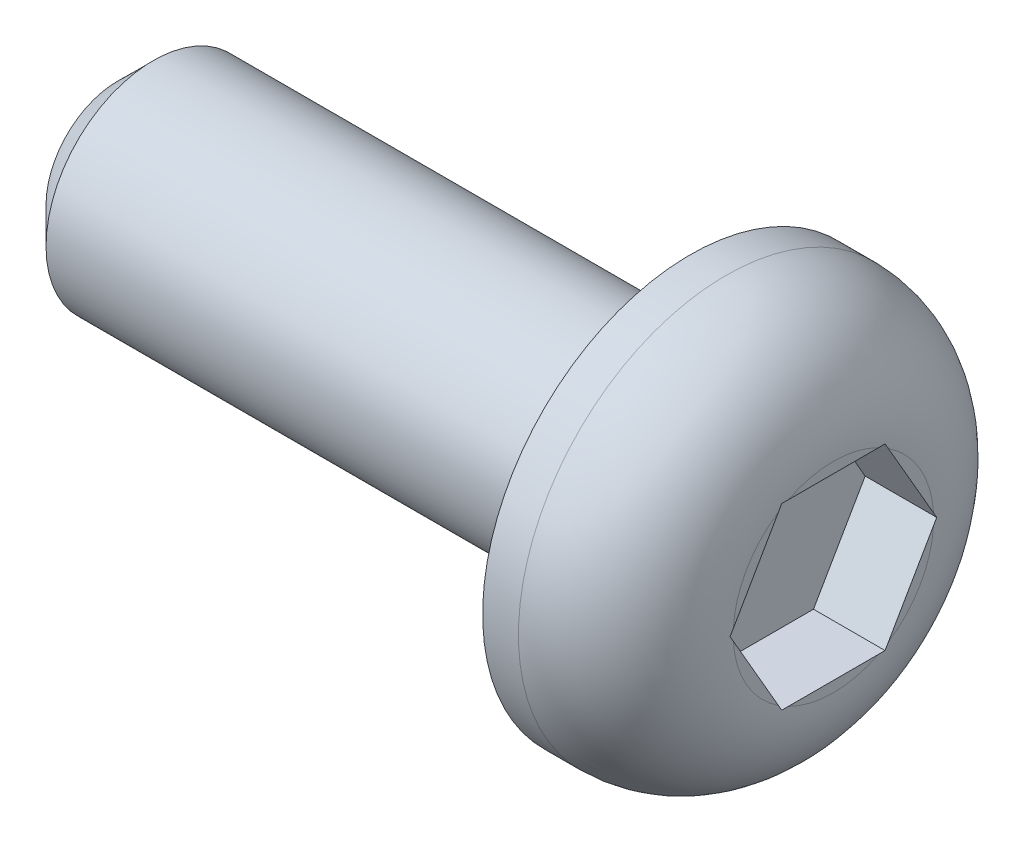
ISO-10303-21;
HEADER;
FILE_DESCRIPTION(('STEP AP214'),'2;1');
FILE_NAME('part.step','',(''),(''),'','','');
FILE_SCHEMA(('AUTOMOTIVE_DESIGN { 1 0 10303 214 1 1 1 1 }'));
ENDSEC;
DATA;
#1=APPLICATION_CONTEXT('core data for automotive mechanical design processes');
#2=APPLICATION_PROTOCOL_DEFINITION('international standard','automotive_design',2000,#1);
#3=PRODUCT_CONTEXT('',#1,'mechanical');
#4=PRODUCT('Part','Part','',(#3));
#5=PRODUCT_RELATED_PRODUCT_CATEGORY('part','',(#4));
#6=PRODUCT_DEFINITION_FORMATION('','',#4);
#7=PRODUCT_DEFINITION_CONTEXT('part definition',#1,'design');
#8=PRODUCT_DEFINITION('design','',#6,#7);
#9=PRODUCT_DEFINITION_SHAPE('','',#8);
#10=(LENGTH_UNIT() NAMED_UNIT(*) SI_UNIT(.MILLI.,.METRE.));
#11=(NAMED_UNIT(*) PLANE_ANGLE_UNIT() SI_UNIT($,.RADIAN.));
#12=(NAMED_UNIT(*) SI_UNIT($,.STERADIAN.) SOLID_ANGLE_UNIT());
#13=UNCERTAINTY_MEASURE_WITH_UNIT(LENGTH_MEASURE(1.E-05),#10,'distance_accuracy_value','');
#14=(GEOMETRIC_REPRESENTATION_CONTEXT(3) GLOBAL_UNCERTAINTY_ASSIGNED_CONTEXT((#13)) GLOBAL_UNIT_ASSIGNED_CONTEXT((#10,
#11,#12)) REPRESENTATION_CONTEXT('',''));
#15=CARTESIAN_POINT('',(0.,0.,0.));
#16=DIRECTION('',(0.,0.,1.));
#17=DIRECTION('',(1.,0.,0.));
#18=AXIS2_PLACEMENT_3D('',#15,#16,#17);
#19=CARTESIAN_POINT('',(2.,0.,0.));
#20=DIRECTION('',(1.,0.,0.));
#21=DIRECTION('',(0.,0.,-1.));
#22=AXIS2_PLACEMENT_3D('',#19,#20,#21);
#23=PLANE('',#22);
#24=DIRECTION('',(0.,-0.866025403784439,-0.5));
#25=VECTOR('',#24,1.);
#26=CARTESIAN_POINT('',(2.,0.,2.94337567297406));
#27=LINE('',#26,#25);
#28=CARTESIAN_POINT('',(2.,-0.0789917583039618,2.89776976005351));
#29=VERTEX_POINT('',#28);
#30=CARTESIAN_POINT('',(2.,-1.17100824169604,2.26729374940759));
#31=VERTEX_POINT('',#30);
#32=EDGE_CURVE('E164',#29,#31,#27,.T.);
#33=ORIENTED_EDGE('',*,*,#32,.F.);
#34=CARTESIAN_POINT('',(2.,0.,1.5));
#35=DIRECTION('',(1.,0.,0.));
#36=DIRECTION('',(0.,0.,-1.));
#37=AXIS2_PLACEMENT_3D('',#34,#35,#36);
#38=CIRCLE('',#37,1.4);
#39=EDGE_CURVE('E201',#29,#31,#38,.T.);
#40=ORIENTED_EDGE('',*,*,#39,.T.);
#41=EDGE_LOOP('',(#33,#40));
#42=FACE_BOUND('',#41,.T.);
#43=ADVANCED_FACE('F34',(#42),#23,.T.);
#44=DIRECTION('',(0.,0.,-1.));
#45=VECTOR('',#44,1.);
#46=CARTESIAN_POINT('',(2.,-1.25,2.22168783648703));
#47=LINE('',#46,#45);
#48=CARTESIAN_POINT('',(2.,-1.25,2.13047601064592));
#49=VERTEX_POINT('',#48);
#50=CARTESIAN_POINT('',(2.,-1.25,0.869523989354076));
#51=VERTEX_POINT('',#50);
#52=EDGE_CURVE('E166',#49,#51,#47,.T.);
#53=ORIENTED_EDGE('',*,*,#52,.F.);
#54=CARTESIAN_POINT('',(2.,0.,1.5));
#55=DIRECTION('',(1.,0.,0.));
#56=DIRECTION('',(0.,0.,-1.));
#57=AXIS2_PLACEMENT_3D('',#54,#55,#56);
#58=CIRCLE('',#57,1.4);
#59=EDGE_CURVE('E199',#49,#51,#58,.T.);
#60=ORIENTED_EDGE('',*,*,#59,.T.);
#61=EDGE_LOOP('',(#53,#60));
#62=FACE_BOUND('',#61,.T.);
#63=ADVANCED_FACE('F254',(#62),#23,.T.);
#64=DIRECTION('',(0.,0.866025403784439,-0.5));
#65=VECTOR('',#64,1.);
#66=CARTESIAN_POINT('',(2.,-1.25,0.778312163512968));
#67=LINE('',#66,#65);
#68=CARTESIAN_POINT('',(2.,-1.17100824169604,0.732706250592413));
#69=VERTEX_POINT('',#68);
#70=CARTESIAN_POINT('',(2.,-0.0789917583039615,0.102230239946489));
#71=VERTEX_POINT('',#70);
#72=EDGE_CURVE('E169',#69,#71,#67,.T.);
#73=ORIENTED_EDGE('',*,*,#72,.F.);
#74=CARTESIAN_POINT('',(2.,0.,1.5));
#75=DIRECTION('',(1.,0.,0.));
#76=DIRECTION('',(0.,0.,-1.));
#77=AXIS2_PLACEMENT_3D('',#74,#75,#76);
#78=CIRCLE('',#77,1.4);
#79=EDGE_CURVE('E197',#69,#71,#78,.T.);
#80=ORIENTED_EDGE('',*,*,#79,.T.);
#81=EDGE_LOOP('',(#73,#80));
#82=FACE_BOUND('',#81,.T.);
#83=ADVANCED_FACE('F259',(#82),#23,.T.);
#84=DIRECTION('',(0.,0.866025403784439,0.5));
#85=VECTOR('',#84,1.);
#86=CARTESIAN_POINT('',(2.,0.,0.0566243270259353));
#87=LINE('',#86,#85);
#88=CARTESIAN_POINT('',(2.,0.078991758303962,0.102230239946489));
#89=VERTEX_POINT('',#88);
#90=CARTESIAN_POINT('',(2.,1.17100824169604,0.732706250592413));
#91=VERTEX_POINT('',#90);
#92=EDGE_CURVE('E172',#89,#91,#87,.T.);
#93=ORIENTED_EDGE('',*,*,#92,.F.);
#94=CARTESIAN_POINT('',(2.,0.,1.5));
#95=DIRECTION('',(1.,0.,0.));
#96=DIRECTION('',(0.,0.,-1.));
#97=AXIS2_PLACEMENT_3D('',#94,#95,#96);
#98=CIRCLE('',#97,1.4);
#99=EDGE_CURVE('E195',#89,#91,#98,.T.);
#100=ORIENTED_EDGE('',*,*,#99,.T.);
#101=EDGE_LOOP('',(#93,#100));
#102=FACE_BOUND('',#101,.T.);
#103=ADVANCED_FACE('F249',(#102),#23,.T.);
#104=DIRECTION('',(0.,0.,1.));
#105=VECTOR('',#104,1.);
#106=CARTESIAN_POINT('',(2.,1.25,0.778312163512968));
#107=LINE('',#106,#105);
#108=CARTESIAN_POINT('',(2.,1.25,0.869523989354076));
#109=VERTEX_POINT('',#108);
#110=CARTESIAN_POINT('',(2.,1.25,2.13047601064592));
#111=VERTEX_POINT('',#110);
#112=EDGE_CURVE('E154',#109,#111,#107,.T.);
#113=ORIENTED_EDGE('',*,*,#112,.F.);
#114=CARTESIAN_POINT('',(2.,0.,1.5));
#115=DIRECTION('',(1.,0.,0.));
#116=DIRECTION('',(0.,0.,-1.));
#117=AXIS2_PLACEMENT_3D('',#114,#115,#116);
#118=CIRCLE('',#117,1.4);
#119=EDGE_CURVE('E193',#109,#111,#118,.T.);
#120=ORIENTED_EDGE('',*,*,#119,.T.);
#121=EDGE_LOOP('',(#113,#120));
#122=FACE_BOUND('',#121,.T.);
#123=ADVANCED_FACE('F240',(#122),#23,.T.);
#124=CARTESIAN_POINT('',(0.,0.,1.5));
#125=DIRECTION('',(1.,0.,0.));
#126=DIRECTION('',(0.,0.,-1.));
#127=AXIS2_PLACEMENT_3D('',#124,#125,#126);
#128=CYLINDRICAL_SURFACE('',#127,1.5);
#129=CARTESIAN_POINT('',(-7.5,0.,1.5));
#130=DIRECTION('',(-1.,0.,0.));
#131=DIRECTION('',(0.,0.,1.));
#132=AXIS2_PLACEMENT_3D('',#129,#130,#131);
#133=CIRCLE('',#132,1.5);
#134=CARTESIAN_POINT('',(-7.5,0.,3.));
#135=VERTEX_POINT('',#134);
#136=EDGE_CURVE('E42',#135,#135,#133,.F.);
#137=ORIENTED_EDGE('',*,*,#136,.T.);
#138=EDGE_LOOP('',(#137));
#139=FACE_BOUND('',#138,.T.);
#140=CARTESIAN_POINT('',(0.,0.,1.5));
#141=DIRECTION('',(1.,0.,0.));
#142=DIRECTION('',(0.,0.,-1.));
#143=AXIS2_PLACEMENT_3D('',#140,#141,#142);
#144=CIRCLE('',#143,1.5);
#145=CARTESIAN_POINT('',(0.,0.,0.));
#146=VERTEX_POINT('',#145);
#147=EDGE_CURVE('E177',#146,#146,#144,.T.);
#148=ORIENTED_EDGE('',*,*,#147,.F.);
#149=EDGE_LOOP('',(#148));
#150=FACE_BOUND('',#149,.T.);
#151=ADVANCED_FACE('F242',(#139,#150),#128,.T.);
#152=CARTESIAN_POINT('',(-8.,0.,0.));
#153=DIRECTION('',(-1.,0.,0.));
#154=DIRECTION('',(0.,0.,1.));
#155=AXIS2_PLACEMENT_3D('',#152,#153,#154);
#156=PLANE('',#155);
#157=CARTESIAN_POINT('',(-8.,0.,1.5));
#158=DIRECTION('',(-1.,0.,0.));
#159=DIRECTION('',(0.,0.,1.));
#160=AXIS2_PLACEMENT_3D('',#157,#158,#159);
#161=CIRCLE('',#160,0.999999999999998);
#162=CARTESIAN_POINT('',(-8.,0.,2.5));
#163=VERTEX_POINT('',#162);
#164=EDGE_CURVE('E11',#163,#163,#161,.T.);
#165=ORIENTED_EDGE('',*,*,#164,.T.);
#166=EDGE_LOOP('',(#165));
#167=FACE_BOUND('',#166,.T.);
#168=ADVANCED_FACE('F238',(#167),#156,.T.);
#169=DIRECTION('',(0.,-0.866025403784439,0.5));
#170=VECTOR('',#169,1.);
#171=CARTESIAN_POINT('',(2.,1.25,2.22168783648703));
#172=LINE('',#171,#170);
#173=CARTESIAN_POINT('',(2.,1.17100824169604,2.26729374940759));
#174=VERTEX_POINT('',#173);
#175=CARTESIAN_POINT('',(2.,0.0789917583039618,2.89776976005351));
#176=VERTEX_POINT('',#175);
#177=EDGE_CURVE('E151',#174,#176,#172,.T.);
#178=ORIENTED_EDGE('',*,*,#177,.F.);
#179=CARTESIAN_POINT('',(2.,0.,1.5));
#180=DIRECTION('',(1.,0.,0.));
#181=DIRECTION('',(0.,0.,-1.));
#182=AXIS2_PLACEMENT_3D('',#179,#180,#181);
#183=CIRCLE('',#182,1.4);
#184=EDGE_CURVE('E191',#174,#176,#183,.T.);
#185=ORIENTED_EDGE('',*,*,#184,.T.);
#186=EDGE_LOOP('',(#178,#185));
#187=FACE_BOUND('',#186,.T.);
#188=ADVANCED_FACE('F234',(#187),#23,.T.);
#189=CARTESIAN_POINT('',(0.,0.,1.5));
#190=DIRECTION('',(1.,0.,0.));
#191=DIRECTION('',(0.,0.,-1.));
#192=AXIS2_PLACEMENT_3D('',#189,#190,#191);
#193=CYLINDRICAL_SURFACE('',#192,2.9);
#194=CARTESIAN_POINT('',(0.5,0.,1.5));
#195=DIRECTION('',(1.,0.,0.));
#196=DIRECTION('',(0.,0.,-1.));
#197=AXIS2_PLACEMENT_3D('',#194,#195,#196);
#198=CIRCLE('',#197,2.9);
#199=CARTESIAN_POINT('',(0.5,0.,-1.4));
#200=VERTEX_POINT('',#199);
#201=EDGE_CURVE('E481',#200,#200,#198,.F.);
#202=ORIENTED_EDGE('',*,*,#201,.T.);
#203=EDGE_LOOP('',(#202));
#204=FACE_BOUND('',#203,.T.);
#205=CARTESIAN_POINT('',(0.,0.,1.5));
#206=DIRECTION('',(1.,0.,0.));
#207=DIRECTION('',(0.,0.,-1.));
#208=AXIS2_PLACEMENT_3D('',#205,#206,#207);
#209=CIRCLE('',#208,2.9);
#210=CARTESIAN_POINT('',(0.,0.,-1.4));
#211=VERTEX_POINT('',#210);
#212=EDGE_CURVE('E188',#211,#211,#209,.T.);
#213=ORIENTED_EDGE('',*,*,#212,.T.);
#214=EDGE_LOOP('',(#213));
#215=FACE_BOUND('',#214,.T.);
#216=ADVANCED_FACE('F230',(#204,#215),#193,.T.);
#217=CARTESIAN_POINT('',(0.,0.,0.));
#218=DIRECTION('',(1.,0.,0.));
#219=DIRECTION('',(0.,0.,-1.));
#220=AXIS2_PLACEMENT_3D('',#217,#218,#219);
#221=PLANE('',#220);
#222=ORIENTED_EDGE('',*,*,#212,.F.);
#223=EDGE_LOOP('',(#222));
#224=FACE_BOUND('',#223,.T.);
#225=ORIENTED_EDGE('',*,*,#147,.T.);
#226=EDGE_LOOP('',(#225));
#227=FACE_BOUND('',#226,.T.);
#228=ADVANCED_FACE('F224',(#224,#227),#221,.F.);
#229=CARTESIAN_POINT('',(1.,0.,2.94337567297406));
#230=DIRECTION('',(0.,-0.5,0.866025403784439));
#231=DIRECTION('',(0.,-0.866025403784439,-0.5));
#232=AXIS2_PLACEMENT_3D('',#229,#230,#231);
#233=PLANE('',#232);
#234=ORIENTED_EDGE('',*,*,#32,.T.);
#235=CARTESIAN_POINT('',(2.,-1.17100824169604,2.26729374940759));
#236=CARTESIAN_POINT('',(2.00000539805275,-1.1841741811381,2.25969239072658));
#237=CARTESIAN_POINT('',(1.99995582374529,-1.19733979317484,2.25209122107312));
#238=CARTESIAN_POINT('',(1.99974673027623,-1.223670379277,2.23688925009912));
#239=CARTESIAN_POINT('',(1.999587210974,-1.23683535334158,2.22928844877906));
#240=CARTESIAN_POINT('',(1.99937271917094,-1.25,2.22168783648703));
#241=B_SPLINE_CURVE_WITH_KNOTS('',3,(#235,#236,#237,#238,#239,#240),.UNSPECIFIED.,.F.,.F.,(4,2,
4),(0.,0.0456072604102866,0.091214579155444),.UNSPECIFIED.);
#242=CARTESIAN_POINT('',(1.99937271917094,-1.25,2.22168783648703));
#243=VERTEX_POINT('',#242);
#244=EDGE_CURVE('E133',#31,#243,#241,.T.);
#245=ORIENTED_EDGE('',*,*,#244,.T.);
#246=DIRECTION('',(1.,0.,0.));
#247=VECTOR('',#246,1.);
#248=CARTESIAN_POINT('',(1.,-1.25,2.22168783648703));
#249=LINE('',#248,#247);
#250=CARTESIAN_POINT('',(1.,-1.25,2.22168783648703));
#251=VERTEX_POINT('',#250);
#252=EDGE_CURVE('E125',#251,#243,#249,.T.);
#253=ORIENTED_EDGE('',*,*,#252,.F.);
#254=DIRECTION('',(0.,-0.866025403784439,-0.5));
#255=VECTOR('',#254,1.);
#256=CARTESIAN_POINT('',(1.,0.,2.94337567297406));
#257=LINE('',#256,#255);
#258=CARTESIAN_POINT('',(1.,0.,2.94337567297406));
#259=VERTEX_POINT('',#258);
#260=EDGE_CURVE('E131',#259,#251,#257,.T.);
#261=ORIENTED_EDGE('',*,*,#260,.F.);
#262=DIRECTION('',(1.,0.,0.));
#263=VECTOR('',#262,1.);
#264=CARTESIAN_POINT('',(1.,0.,2.94337567297406));
#265=LINE('',#264,#263);
#266=CARTESIAN_POINT('',(1.99937271917094,0.,2.94337567297406));
#267=VERTEX_POINT('',#266);
#268=EDGE_CURVE('E175',#259,#267,#265,.T.);
#269=ORIENTED_EDGE('',*,*,#268,.T.);
#270=CARTESIAN_POINT('',(1.99937271917094,0.,2.94337567297406));
#271=CARTESIAN_POINT('',(1.999587210974,-0.013164646658419,2.93577506068204));
#272=CARTESIAN_POINT('',(1.99974673027623,-0.0263296207229975,2.92817425936198));
#273=CARTESIAN_POINT('',(1.99995582374529,-0.0526602068251557,2.91297228838798));
#274=CARTESIAN_POINT('',(2.00000539805275,-0.0658258188618977,2.90537111873452));
#275=CARTESIAN_POINT('',(2.,-0.0789917583039617,2.89776976005351));
#276=B_SPLINE_CURVE_WITH_KNOTS('',3,(#270,#271,#272,#273,#274,#275),.UNSPECIFIED.,.F.,.F.,(4,2,
4),(0.,0.0456073187451573,0.0912145791554442),.UNSPECIFIED.);
#277=EDGE_CURVE('E204',#267,#29,#276,.T.);
#278=ORIENTED_EDGE('',*,*,#277,.T.);
#279=EDGE_LOOP('',(#234,#245,#253,#261,#269,#278));
#280=FACE_BOUND('',#279,.T.);
#281=ADVANCED_FACE('F128',(#280),#233,.F.);
#282=CARTESIAN_POINT('',(1.,1.25,2.22168783648703));
#283=DIRECTION('',(0.,0.5,0.866025403784439));
#284=DIRECTION('',(0.,-0.866025403784439,0.5));
#285=AXIS2_PLACEMENT_3D('',#282,#283,#284);
#286=PLANE('',#285);
#287=DIRECTION('',(1.,0.,0.));
#288=VECTOR('',#287,1.);
#289=CARTESIAN_POINT('',(1.,1.25,2.22168783648703));
#290=LINE('',#289,#288);
#291=CARTESIAN_POINT('',(1.,1.25,2.22168783648703));
#292=VERTEX_POINT('',#291);
#293=CARTESIAN_POINT('',(1.99937271917094,1.25,2.22168783648703));
#294=VERTEX_POINT('',#293);
#295=EDGE_CURVE('E178',#292,#294,#290,.T.);
#296=ORIENTED_EDGE('',*,*,#295,.T.);
#297=CARTESIAN_POINT('',(1.99937271917094,1.25,2.22168783648703));
#298=CARTESIAN_POINT('',(1.999587210974,1.23683535334158,2.22928844877906));
#299=CARTESIAN_POINT('',(1.99974673027623,1.223670379277,2.23688925009912));
#300=CARTESIAN_POINT('',(1.99995582374529,1.19733979317484,2.25209122107312));
#301=CARTESIAN_POINT('',(2.00000539805275,1.1841741811381,2.25969239072658));
#302=CARTESIAN_POINT('',(2.,1.17100824169604,2.26729374940759));
#303=B_SPLINE_CURVE_WITH_KNOTS('',3,(#297,#298,#299,#300,#301,#302),.UNSPECIFIED.,.F.,.F.,(4,2,
4),(0.,0.0456073187451577,0.0912145791554448),.UNSPECIFIED.);
#304=EDGE_CURVE('E334',#294,#174,#303,.T.);
#305=ORIENTED_EDGE('',*,*,#304,.T.);
#306=ORIENTED_EDGE('',*,*,#177,.T.);
#307=CARTESIAN_POINT('',(2.,0.078991758303962,2.89776976005351));
#308=CARTESIAN_POINT('',(2.00000539805275,0.0658258188618978,2.90537111873452));
#309=CARTESIAN_POINT('',(1.99995582374529,0.0526602068251558,2.91297228838798));
#310=CARTESIAN_POINT('',(1.99974673027623,0.0263296207229975,2.92817425936198));
#311=CARTESIAN_POINT('',(1.999587210974,0.0131646466584189,2.93577506068204));
#312=CARTESIAN_POINT('',(1.99937271917094,0.,2.94337567297406));
#313=B_SPLINE_CURVE_WITH_KNOTS('',3,(#307,#308,#309,#310,#311,#312),.UNSPECIFIED.,.F.,.F.,(4,2,
4),(0.,0.0456072604102868,0.0912145791554442),.UNSPECIFIED.);
#314=EDGE_CURVE('E328',#176,#267,#313,.T.);
#315=ORIENTED_EDGE('',*,*,#314,.T.);
#316=ORIENTED_EDGE('',*,*,#268,.F.);
#317=DIRECTION('',(0.,-0.866025403784439,0.5));
#318=VECTOR('',#317,1.);
#319=CARTESIAN_POINT('',(1.,1.25,2.22168783648703));
#320=LINE('',#319,#318);
#321=EDGE_CURVE('E137',#292,#259,#320,.T.);
#322=ORIENTED_EDGE('',*,*,#321,.F.);
#323=EDGE_LOOP('',(#296,#305,#306,#315,#316,#322));
#324=FACE_BOUND('',#323,.T.);
#325=ADVANCED_FACE('F223',(#324),#286,.F.);
#326=CARTESIAN_POINT('',(1.,1.25,0.778312163512968));
#327=DIRECTION('',(0.,1.,0.));
#328=DIRECTION('',(0.,0.,1.));
#329=AXIS2_PLACEMENT_3D('',#326,#327,#328);
#330=PLANE('',#329);
#331=DIRECTION('',(1.,0.,0.));
#332=VECTOR('',#331,1.);
#333=CARTESIAN_POINT('',(1.,1.25,0.778312163512968));
#334=LINE('',#333,#332);
#335=CARTESIAN_POINT('',(1.,1.25,0.778312163512968));
#336=VERTEX_POINT('',#335);
#337=CARTESIAN_POINT('',(1.99937271917094,1.25,0.778312163512968));
#338=VERTEX_POINT('',#337);
#339=EDGE_CURVE('E180',#336,#338,#334,.T.);
#340=ORIENTED_EDGE('',*,*,#339,.T.);
#341=CARTESIAN_POINT('',(1.99937271917094,1.25,0.778312163512968));
#342=CARTESIAN_POINT('',(1.999587210974,1.25,0.793513388097017));
#343=CARTESIAN_POINT('',(1.99974673027623,1.25,0.808714990737134));
#344=CARTESIAN_POINT('',(1.99995582374529,1.25,0.839118932685138));
#345=CARTESIAN_POINT('',(2.00000539805275,1.25,0.854321271992056));
#346=CARTESIAN_POINT('',(2.,1.25,0.869523989354076));
#347=B_SPLINE_CURVE_WITH_KNOTS('',3,(#341,#342,#343,#344,#345,#346),.UNSPECIFIED.,.F.,.F.,(4,2,
4),(0.,0.0456073187451577,0.0912145791554446),.UNSPECIFIED.);
#348=EDGE_CURVE('E322',#338,#109,#347,.T.);
#349=ORIENTED_EDGE('',*,*,#348,.T.);
#350=ORIENTED_EDGE('',*,*,#112,.T.);
#351=CARTESIAN_POINT('',(2.,1.25,2.13047601064592));
#352=CARTESIAN_POINT('',(2.00000539805275,1.25,2.14567872800794));
#353=CARTESIAN_POINT('',(1.99995582374529,1.25,2.16088106731486));
#354=CARTESIAN_POINT('',(1.99974673027623,1.25,2.19128500926286));
#355=CARTESIAN_POINT('',(1.999587210974,1.25,2.20648661190298));
#356=CARTESIAN_POINT('',(1.99937271917094,1.25,2.22168783648703));
#357=B_SPLINE_CURVE_WITH_KNOTS('',3,(#351,#352,#353,#354,#355,#356),.UNSPECIFIED.,.F.,.F.,(4,2,
4),(0.,0.0456072604102873,0.0912145791554451),.UNSPECIFIED.);
#358=EDGE_CURVE('E49',#111,#294,#357,.T.);
#359=ORIENTED_EDGE('',*,*,#358,.T.);
#360=ORIENTED_EDGE('',*,*,#295,.F.);
#361=DIRECTION('',(0.,0.,1.));
#362=VECTOR('',#361,1.);
#363=CARTESIAN_POINT('',(1.,1.25,0.778312163512968));
#364=LINE('',#363,#362);
#365=EDGE_CURVE('E161',#336,#292,#364,.T.);
#366=ORIENTED_EDGE('',*,*,#365,.F.);
#367=EDGE_LOOP('',(#340,#349,#350,#359,#360,#366));
#368=FACE_BOUND('',#367,.T.);
#369=ADVANCED_FACE('F302',(#368),#330,.F.);
#370=CARTESIAN_POINT('',(1.,0.,0.0566243270259354));
#371=DIRECTION('',(0.,0.5,-0.866025403784439));
#372=DIRECTION('',(0.,0.866025403784439,0.5));
#373=AXIS2_PLACEMENT_3D('',#370,#371,#372);
#374=PLANE('',#373);
#375=DIRECTION('',(1.,0.,0.));
#376=VECTOR('',#375,1.);
#377=CARTESIAN_POINT('',(1.,0.,0.0566243270259354));
#378=LINE('',#377,#376);
#379=CARTESIAN_POINT('',(1.,0.,0.0566243270259354));
#380=VERTEX_POINT('',#379);
#381=CARTESIAN_POINT('',(1.99937271917094,0.,0.0566243270259353));
#382=VERTEX_POINT('',#381);
#383=EDGE_CURVE('E182',#380,#382,#378,.T.);
#384=ORIENTED_EDGE('',*,*,#383,.T.);
#385=CARTESIAN_POINT('',(1.99937271917094,0.,0.0566243270259353));
#386=CARTESIAN_POINT('',(1.999587210974,0.013164646658419,0.0642249393179598));
#387=CARTESIAN_POINT('',(1.99974673027623,0.0263296207229976,0.0718257406380187));
#388=CARTESIAN_POINT('',(1.99995582374529,0.0526602068251558,0.0870277116120203));
#389=CARTESIAN_POINT('',(2.00000539805275,0.0658258188618978,0.0946288812654795));
#390=CARTESIAN_POINT('',(2.,0.0789917583039619,0.102230239946489));
#391=B_SPLINE_CURVE_WITH_KNOTS('',3,(#385,#386,#387,#388,#389,#390),.UNSPECIFIED.,.F.,.F.,(4,2,
4),(0.,0.0456073187451575,0.0912145791554442),.UNSPECIFIED.);
#392=EDGE_CURVE('E311',#382,#89,#391,.T.);
#393=ORIENTED_EDGE('',*,*,#392,.T.);
#394=ORIENTED_EDGE('',*,*,#92,.T.);
#395=CARTESIAN_POINT('',(2.,1.17100824169604,0.732706250592413));
#396=CARTESIAN_POINT('',(2.00000539805275,1.1841741811381,0.740307609273423));
#397=CARTESIAN_POINT('',(1.99995582374529,1.19733979317484,0.747908778926882));
#398=CARTESIAN_POINT('',(1.99974673027623,1.223670379277,0.763110749900884));
#399=CARTESIAN_POINT('',(1.999587210974,1.23683535334158,0.770711551220943));
#400=CARTESIAN_POINT('',(1.99937271917094,1.25,0.778312163512967));
#401=B_SPLINE_CURVE_WITH_KNOTS('',3,(#395,#396,#397,#398,#399,#400),.UNSPECIFIED.,.F.,.F.,(4,2,
4),(0.,0.045607260410287,0.0912145791554446),.UNSPECIFIED.);
#402=EDGE_CURVE('E57',#91,#338,#401,.T.);
#403=ORIENTED_EDGE('',*,*,#402,.T.);
#404=ORIENTED_EDGE('',*,*,#339,.F.);
#405=DIRECTION('',(0.,0.866025403784439,0.5));
#406=VECTOR('',#405,1.);
#407=CARTESIAN_POINT('',(1.,0.,0.0566243270259354));
#408=LINE('',#407,#406);
#409=EDGE_CURVE('E158',#380,#336,#408,.T.);
#410=ORIENTED_EDGE('',*,*,#409,.F.);
#411=EDGE_LOOP('',(#384,#393,#394,#403,#404,#410));
#412=FACE_BOUND('',#411,.T.);
#413=ADVANCED_FACE('F296',(#412),#374,.F.);
#414=CARTESIAN_POINT('',(1.,-1.25,0.778312163512968));
#415=DIRECTION('',(0.,-0.5,-0.866025403784439));
#416=DIRECTION('',(0.,0.866025403784439,-0.5));
#417=AXIS2_PLACEMENT_3D('',#414,#415,#416);
#418=PLANE('',#417);
#419=DIRECTION('',(1.,0.,0.));
#420=VECTOR('',#419,1.);
#421=CARTESIAN_POINT('',(1.,-1.25,0.778312163512968));
#422=LINE('',#421,#420);
#423=CARTESIAN_POINT('',(1.,-1.25,0.778312163512968));
#424=VERTEX_POINT('',#423);
#425=CARTESIAN_POINT('',(1.99937271917094,-1.25,0.778312163512968));
#426=VERTEX_POINT('',#425);
#427=EDGE_CURVE('E136',#424,#426,#422,.T.);
#428=ORIENTED_EDGE('',*,*,#427,.T.);
#429=CARTESIAN_POINT('',(1.99937271917094,-1.25,0.778312163512968));
#430=CARTESIAN_POINT('',(1.999587210974,-1.23683535334158,0.770711551220943));
#431=CARTESIAN_POINT('',(1.99974673027623,-1.223670379277,0.763110749900884));
#432=CARTESIAN_POINT('',(1.99995582374529,-1.19733979317484,0.747908778926882));
#433=CARTESIAN_POINT('',(2.00000539805275,-1.1841741811381,0.740307609273423));
#434=CARTESIAN_POINT('',(2.,-1.17100824169604,0.732706250592413));
#435=B_SPLINE_CURVE_WITH_KNOTS('',3,(#429,#430,#431,#432,#433,#434),.UNSPECIFIED.,.F.,.F.,(4,2,
4),(0.,0.0456073187451579,0.0912145791554448),.UNSPECIFIED.);
#436=EDGE_CURVE('E286',#426,#69,#435,.T.);
#437=ORIENTED_EDGE('',*,*,#436,.T.);
#438=ORIENTED_EDGE('',*,*,#72,.T.);
#439=CARTESIAN_POINT('',(2.,-0.078991758303962,0.102230239946489));
#440=CARTESIAN_POINT('',(2.00000539805275,-0.0658258188618978,0.0946288812654794));
#441=CARTESIAN_POINT('',(1.99995582374529,-0.0526602068251558,0.0870277116120203));
#442=CARTESIAN_POINT('',(1.99974673027623,-0.0263296207229976,0.0718257406380187));
#443=CARTESIAN_POINT('',(1.999587210974,-0.0131646466584189,0.0642249393179598));
#444=CARTESIAN_POINT('',(1.99937271917094,0.,0.0566243270259353));
#445=B_SPLINE_CURVE_WITH_KNOTS('',3,(#439,#440,#441,#442,#443,#444),.UNSPECIFIED.,.F.,.F.,(4,2,
4),(0.,0.0456072604102868,0.0912145791554442),.UNSPECIFIED.);
#446=EDGE_CURVE('E270',#71,#382,#445,.T.);
#447=ORIENTED_EDGE('',*,*,#446,.T.);
#448=ORIENTED_EDGE('',*,*,#383,.F.);
#449=DIRECTION('',(0.,0.866025403784439,-0.5));
#450=VECTOR('',#449,1.);
#451=CARTESIAN_POINT('',(1.,-1.25,0.778312163512968));
#452=LINE('',#451,#450);
#453=EDGE_CURVE('E146',#424,#380,#452,.T.);
#454=ORIENTED_EDGE('',*,*,#453,.F.);
#455=EDGE_LOOP('',(#428,#437,#438,#447,#448,#454));
#456=FACE_BOUND('',#455,.T.);
#457=ADVANCED_FACE('F292',(#456),#418,.F.);
#458=CARTESIAN_POINT('',(1.,-1.25,2.22168783648703));
#459=DIRECTION('',(0.,-1.,0.));
#460=DIRECTION('',(0.,0.,-1.));
#461=AXIS2_PLACEMENT_3D('',#458,#459,#460);
#462=PLANE('',#461);
#463=ORIENTED_EDGE('',*,*,#252,.T.);
#464=CARTESIAN_POINT('',(1.99937271917094,-1.25,2.22168783648703));
#465=CARTESIAN_POINT('',(1.999587210974,-1.25,2.20648661190298));
#466=CARTESIAN_POINT('',(1.99974673027623,-1.25,2.19128500926286));
#467=CARTESIAN_POINT('',(1.99995582374529,-1.25,2.16088106731486));
#468=CARTESIAN_POINT('',(2.00000539805275,-1.25,2.14567872800794));
#469=CARTESIAN_POINT('',(2.,-1.25,2.13047601064592));
#470=B_SPLINE_CURVE_WITH_KNOTS('',3,(#464,#465,#466,#467,#468,#469),.UNSPECIFIED.,.F.,.F.,(4,2,
4),(0.,0.0456073187451577,0.0912145791554442),.UNSPECIFIED.);
#471=EDGE_CURVE('E267',#243,#49,#470,.T.);
#472=ORIENTED_EDGE('',*,*,#471,.T.);
#473=ORIENTED_EDGE('',*,*,#52,.T.);
#474=CARTESIAN_POINT('',(2.,-1.25,0.869523989354076));
#475=CARTESIAN_POINT('',(2.00000539805275,-1.25,0.854321271992056));
#476=CARTESIAN_POINT('',(1.99995582374529,-1.25,0.839118932685138));
#477=CARTESIAN_POINT('',(1.99974673027623,-1.25,0.808714990737134));
#478=CARTESIAN_POINT('',(1.999587210974,-1.25,0.793513388097017));
#479=CARTESIAN_POINT('',(1.99937271917094,-1.25,0.778312163512968));
#480=B_SPLINE_CURVE_WITH_KNOTS('',3,(#474,#475,#476,#477,#478,#479),.UNSPECIFIED.,.F.,.F.,(4,2,
4),(0.,0.0456072604102868,0.0912145791554445),.UNSPECIFIED.);
#481=EDGE_CURVE('E268',#51,#426,#480,.T.);
#482=ORIENTED_EDGE('',*,*,#481,.T.);
#483=ORIENTED_EDGE('',*,*,#427,.F.);
#484=DIRECTION('',(0.,0.,-1.));
#485=VECTOR('',#484,1.);
#486=CARTESIAN_POINT('',(1.,-1.25,2.22168783648703));
#487=LINE('',#486,#485);
#488=EDGE_CURVE('E140',#251,#424,#487,.T.);
#489=ORIENTED_EDGE('',*,*,#488,.F.);
#490=EDGE_LOOP('',(#463,#472,#473,#482,#483,#489));
#491=FACE_BOUND('',#490,.T.);
#492=ADVANCED_FACE('F141',(#491),#462,.F.);
#493=CARTESIAN_POINT('',(0.999999999999999,0.,0.));
#494=DIRECTION('',(1.,0.,0.));
#495=DIRECTION('',(0.,0.,-1.));
#496=AXIS2_PLACEMENT_3D('',#493,#494,#495);
#497=PLANE('',#496);
#498=ORIENTED_EDGE('',*,*,#260,.T.);
#499=ORIENTED_EDGE('',*,*,#488,.T.);
#500=ORIENTED_EDGE('',*,*,#453,.T.);
#501=ORIENTED_EDGE('',*,*,#409,.T.);
#502=ORIENTED_EDGE('',*,*,#365,.T.);
#503=ORIENTED_EDGE('',*,*,#321,.T.);
#504=EDGE_LOOP('',(#498,#499,#500,#501,#502,#503));
#505=FACE_BOUND('',#504,.T.);
#506=ADVANCED_FACE('F148',(#505),#497,.T.);
#507=CARTESIAN_POINT('',(0.5,0.,1.5));
#508=DIRECTION('',(1.,0.,0.));
#509=DIRECTION('',(0.,0.,-1.));
#510=AXIS2_PLACEMENT_3D('',#507,#508,#509);
#511=DEGENERATE_TOROIDAL_SURFACE('',#510,1.4,1.5,.T.);
#512=ORIENTED_EDGE('',*,*,#201,.F.);
#513=EDGE_LOOP('',(#512));
#514=FACE_BOUND('',#513,.T.);
#515=ORIENTED_EDGE('',*,*,#244,.F.);
#516=ORIENTED_EDGE('',*,*,#39,.F.);
#517=ORIENTED_EDGE('',*,*,#277,.F.);
#518=ORIENTED_EDGE('',*,*,#314,.F.);
#519=ORIENTED_EDGE('',*,*,#184,.F.);
#520=ORIENTED_EDGE('',*,*,#304,.F.);
#521=ORIENTED_EDGE('',*,*,#358,.F.);
#522=ORIENTED_EDGE('',*,*,#119,.F.);
#523=ORIENTED_EDGE('',*,*,#348,.F.);
#524=ORIENTED_EDGE('',*,*,#402,.F.);
#525=ORIENTED_EDGE('',*,*,#99,.F.);
#526=ORIENTED_EDGE('',*,*,#392,.F.);
#527=ORIENTED_EDGE('',*,*,#446,.F.);
#528=ORIENTED_EDGE('',*,*,#79,.F.);
#529=ORIENTED_EDGE('',*,*,#436,.F.);
#530=ORIENTED_EDGE('',*,*,#481,.F.);
#531=ORIENTED_EDGE('',*,*,#59,.F.);
#532=ORIENTED_EDGE('',*,*,#471,.F.);
#533=EDGE_LOOP('',(#515,#516,#517,#518,#519,#520,#521,#522,#523,#524,#525,#526,#527,#528,#529,
#530,#531,#532));
#534=FACE_BOUND('',#533,.T.);
#535=ADVANCED_FACE('F216',(#514,#534),#511,.T.);
#536=CARTESIAN_POINT('',(-7.5,0.,1.5));
#537=DIRECTION('',(1.,0.,0.));
#538=DIRECTION('',(0.,0.,-1.));
#539=AXIS2_PLACEMENT_3D('',#536,#537,#538);
#540=CONICAL_SURFACE('',#539,1.5,0.78539816339745);
#541=ORIENTED_EDGE('',*,*,#164,.F.);
#542=EDGE_LOOP('',(#541));
#543=FACE_BOUND('',#542,.T.);
#544=ORIENTED_EDGE('',*,*,#136,.F.);
#545=EDGE_LOOP('',(#544));
#546=FACE_BOUND('',#545,.T.);
#547=ADVANCED_FACE('F36',(#543,#546),#540,.T.);
#548=CLOSED_SHELL('',(#43,#63,#83,#103,#123,#151,#168,#188,#216,#228,#281,#325,#369,#413,#457,
#492,#506,#535,#547));
#549=MANIFOLD_SOLID_BREP('B2',#548);
#550=ADVANCED_BREP_SHAPE_REPRESENTATION('',(#18,#549),#14);
#551=SHAPE_DEFINITION_REPRESENTATION(#9,#550);
ENDSEC;
END-ISO-10303-21;
